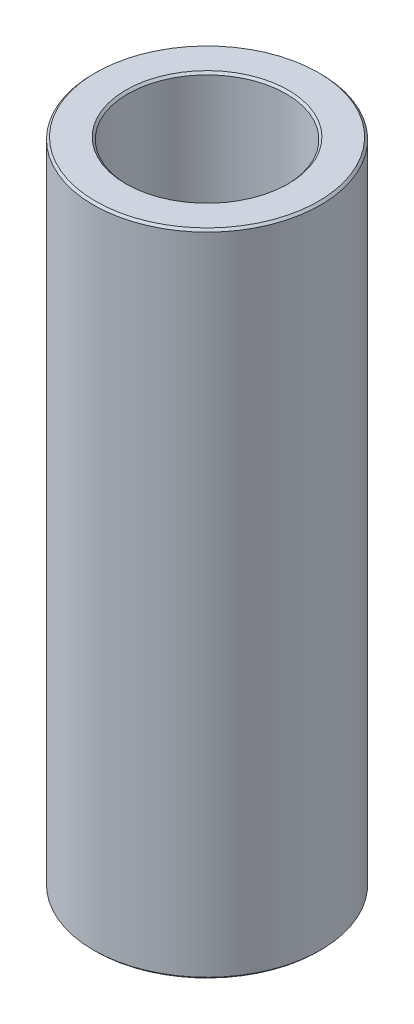
ISO-10303-21;
HEADER;
FILE_DESCRIPTION(('STEP AP214'),'2;1');
FILE_NAME('part.step','',(''),(''),'','','');
FILE_SCHEMA(('AUTOMOTIVE_DESIGN { 1 0 10303 214 1 1 1 1 }'));
ENDSEC;
DATA;
#1=APPLICATION_CONTEXT('core data for automotive mechanical design processes');
#2=APPLICATION_PROTOCOL_DEFINITION('international standard','automotive_design',2000,#1);
#3=PRODUCT_CONTEXT('',#1,'mechanical');
#4=PRODUCT('Part','Part','',(#3));
#5=PRODUCT_RELATED_PRODUCT_CATEGORY('part','',(#4));
#6=PRODUCT_DEFINITION_FORMATION('','',#4);
#7=PRODUCT_DEFINITION_CONTEXT('part definition',#1,'design');
#8=PRODUCT_DEFINITION('design','',#6,#7);
#9=PRODUCT_DEFINITION_SHAPE('','',#8);
#10=(LENGTH_UNIT() NAMED_UNIT(*) SI_UNIT(.MILLI.,.METRE.));
#11=(NAMED_UNIT(*) PLANE_ANGLE_UNIT() SI_UNIT($,.RADIAN.));
#12=(NAMED_UNIT(*) SI_UNIT($,.STERADIAN.) SOLID_ANGLE_UNIT());
#13=UNCERTAINTY_MEASURE_WITH_UNIT(LENGTH_MEASURE(1.E-05),#10,'distance_accuracy_value','');
#14=(GEOMETRIC_REPRESENTATION_CONTEXT(3) GLOBAL_UNCERTAINTY_ASSIGNED_CONTEXT((#13)) GLOBAL_UNIT_ASSIGNED_CONTEXT((#10,
#11,#12)) REPRESENTATION_CONTEXT('',''));
#15=CARTESIAN_POINT('',(0.,0.,0.));
#16=DIRECTION('',(0.,0.,1.));
#17=DIRECTION('',(1.,0.,0.));
#18=AXIS2_PLACEMENT_3D('',#15,#16,#17);
#19=CARTESIAN_POINT('',(0.,200.167303581127,0.));
#20=DIRECTION('',(0.,-1.,0.));
#21=DIRECTION('',(0.,0.,-1.));
#22=AXIS2_PLACEMENT_3D('',#19,#20,#21);
#23=CYLINDRICAL_SURFACE('',#22,35.);
#24=CARTESIAN_POINT('',(0.,0.663652062752096,0.));
#25=DIRECTION('',(0.,1.,0.));
#26=DIRECTION('',(0.,0.,1.));
#27=AXIS2_PLACEMENT_3D('',#24,#25,#26);
#28=CIRCLE('',#27,35.);
#29=CARTESIAN_POINT('',(0.,0.663652062752096,35.));
#30=VERTEX_POINT('',#29);
#31=EDGE_CURVE('E10',#30,#30,#28,.T.);
#32=ORIENTED_EDGE('',*,*,#31,.T.);
#33=EDGE_LOOP('',(#32));
#34=FACE_BOUND('',#33,.T.);
#35=CARTESIAN_POINT('',(0.,199.503651518375,0.));
#36=DIRECTION('',(0.,1.,0.));
#37=DIRECTION('',(0.,0.,1.));
#38=AXIS2_PLACEMENT_3D('',#35,#36,#37);
#39=CIRCLE('',#38,35.);
#40=CARTESIAN_POINT('',(0.,199.503651518375,35.));
#41=VERTEX_POINT('',#40);
#42=EDGE_CURVE('E50',#41,#41,#39,.F.);
#43=ORIENTED_EDGE('',*,*,#42,.T.);
#44=EDGE_LOOP('',(#43));
#45=FACE_BOUND('',#44,.T.);
#46=ADVANCED_FACE('F39',(#34,#45),#23,.T.);
#47=CARTESIAN_POINT('',(0.,200.167303581127,0.));
#48=DIRECTION('',(0.,1.,0.));
#49=DIRECTION('',(0.,0.,1.));
#50=AXIS2_PLACEMENT_3D('',#47,#48,#49);
#51=PLANE('',#50);
#52=CARTESIAN_POINT('',(0.,200.167303581127,0.));
#53=DIRECTION('',(0.,1.,0.));
#54=DIRECTION('',(0.,0.,1.));
#55=AXIS2_PLACEMENT_3D('',#52,#53,#54);
#56=CIRCLE('',#55,25.0389476209901);
#57=CARTESIAN_POINT('',(0.,200.167303581127,25.0389476209901));
#58=VERTEX_POINT('',#57);
#59=EDGE_CURVE('E58',#58,#58,#56,.F.);
#60=ORIENTED_EDGE('',*,*,#59,.T.);
#61=EDGE_LOOP('',(#60));
#62=FACE_BOUND('',#61,.T.);
#63=CARTESIAN_POINT('',(0.,200.167303581127,0.));
#64=DIRECTION('',(0.,1.,0.));
#65=DIRECTION('',(0.,0.,1.));
#66=AXIS2_PLACEMENT_3D('',#63,#64,#65);
#67=CIRCLE('',#66,34.3363479372479);
#68=CARTESIAN_POINT('',(0.,200.167303581127,34.3363479372479));
#69=VERTEX_POINT('',#68);
#70=EDGE_CURVE('E61',#69,#69,#67,.T.);
#71=ORIENTED_EDGE('',*,*,#70,.T.);
#72=EDGE_LOOP('',(#71));
#73=FACE_BOUND('',#72,.T.);
#74=ADVANCED_FACE('F88',(#62,#73),#51,.T.);
#75=CARTESIAN_POINT('',(0.,0.,0.));
#76=DIRECTION('',(0.,1.,0.));
#77=DIRECTION('',(0.,0.,1.));
#78=AXIS2_PLACEMENT_3D('',#75,#76,#77);
#79=PLANE('',#78);
#80=CARTESIAN_POINT('',(0.,0.,0.));
#81=DIRECTION('',(0.,1.,0.));
#82=DIRECTION('',(0.,0.,1.));
#83=AXIS2_PLACEMENT_3D('',#80,#81,#82);
#84=CIRCLE('',#83,25.0389476209901);
#85=CARTESIAN_POINT('',(0.,0.,25.0389476209901));
#86=VERTEX_POINT('',#85);
#87=EDGE_CURVE('E51',#86,#86,#84,.T.);
#88=ORIENTED_EDGE('',*,*,#87,.T.);
#89=EDGE_LOOP('',(#88));
#90=FACE_BOUND('',#89,.T.);
#91=CARTESIAN_POINT('',(0.,0.,0.));
#92=DIRECTION('',(0.,1.,0.));
#93=DIRECTION('',(0.,0.,1.));
#94=AXIS2_PLACEMENT_3D('',#91,#92,#93);
#95=CIRCLE('',#94,34.3363479372479);
#96=CARTESIAN_POINT('',(0.,0.,34.3363479372479));
#97=VERTEX_POINT('',#96);
#98=EDGE_CURVE('E54',#97,#97,#95,.F.);
#99=ORIENTED_EDGE('',*,*,#98,.T.);
#100=EDGE_LOOP('',(#99));
#101=FACE_BOUND('',#100,.T.);
#102=ADVANCED_FACE('F83',(#90,#101),#79,.F.);
#103=CARTESIAN_POINT('',(0.,200.167303581127,0.));
#104=DIRECTION('',(0.,-1.,0.));
#105=DIRECTION('',(0.,0.,-1.));
#106=AXIS2_PLACEMENT_3D('',#103,#104,#105);
#107=CYLINDRICAL_SURFACE('',#106,24.375295558238);
#108=CARTESIAN_POINT('',(0.,199.503651518375,0.));
#109=DIRECTION('',(0.,1.,0.));
#110=DIRECTION('',(0.,0.,1.));
#111=AXIS2_PLACEMENT_3D('',#108,#109,#110);
#112=CIRCLE('',#111,24.375295558238);
#113=CARTESIAN_POINT('',(0.,199.503651518375,24.375295558238));
#114=VERTEX_POINT('',#113);
#115=EDGE_CURVE('E67',#114,#114,#112,.T.);
#116=ORIENTED_EDGE('',*,*,#115,.T.);
#117=EDGE_LOOP('',(#116));
#118=FACE_BOUND('',#117,.T.);
#119=CARTESIAN_POINT('',(0.,0.663652062752124,0.));
#120=DIRECTION('',(0.,1.,0.));
#121=DIRECTION('',(0.,0.,1.));
#122=AXIS2_PLACEMENT_3D('',#119,#120,#121);
#123=CIRCLE('',#122,24.375295558238);
#124=CARTESIAN_POINT('',(0.,0.663652062752124,24.375295558238));
#125=VERTEX_POINT('',#124);
#126=EDGE_CURVE('E69',#125,#125,#123,.F.);
#127=ORIENTED_EDGE('',*,*,#126,.T.);
#128=EDGE_LOOP('',(#127));
#129=FACE_BOUND('',#128,.T.);
#130=ADVANCED_FACE('F71',(#118,#129),#107,.F.);
#131=CARTESIAN_POINT('',(0.,199.503651518375,0.));
#132=DIRECTION('',(0.,1.,0.));
#133=DIRECTION('',(0.,0.,1.));
#134=AXIS2_PLACEMENT_3D('',#131,#132,#133);
#135=CONICAL_SURFACE('',#134,24.375295558238,0.785398163397446);
#136=ORIENTED_EDGE('',*,*,#59,.F.);
#137=EDGE_LOOP('',(#136));
#138=FACE_BOUND('',#137,.T.);
#139=ORIENTED_EDGE('',*,*,#115,.F.);
#140=EDGE_LOOP('',(#139));
#141=FACE_BOUND('',#140,.T.);
#142=ADVANCED_FACE('F77',(#138,#141),#135,.F.);
#143=CARTESIAN_POINT('',(0.,0.,0.));
#144=DIRECTION('',(0.,-1.,0.));
#145=DIRECTION('',(0.,0.,-1.));
#146=AXIS2_PLACEMENT_3D('',#143,#144,#145);
#147=CONICAL_SURFACE('',#146,25.0389476209901,0.785398163397425);
#148=ORIENTED_EDGE('',*,*,#126,.F.);
#149=EDGE_LOOP('',(#148));
#150=FACE_BOUND('',#149,.T.);
#151=ORIENTED_EDGE('',*,*,#87,.F.);
#152=EDGE_LOOP('',(#151));
#153=FACE_BOUND('',#152,.T.);
#154=ADVANCED_FACE('F73',(#150,#153),#147,.F.);
#155=CARTESIAN_POINT('',(0.,0.663652062752096,0.));
#156=DIRECTION('',(0.,1.,0.));
#157=DIRECTION('',(0.,0.,1.));
#158=AXIS2_PLACEMENT_3D('',#155,#156,#157);
#159=CONICAL_SURFACE('',#158,35.,0.785398163397464);
#160=ORIENTED_EDGE('',*,*,#98,.F.);
#161=EDGE_LOOP('',(#160));
#162=FACE_BOUND('',#161,.T.);
#163=ORIENTED_EDGE('',*,*,#31,.F.);
#164=EDGE_LOOP('',(#163));
#165=FACE_BOUND('',#164,.T.);
#166=ADVANCED_FACE('F76',(#162,#165),#159,.T.);
#167=CARTESIAN_POINT('',(0.,200.167303581127,0.));
#168=DIRECTION('',(0.,-1.,0.));
#169=DIRECTION('',(0.,0.,-1.));
#170=AXIS2_PLACEMENT_3D('',#167,#168,#169);
#171=CONICAL_SURFACE('',#170,34.3363479372479,0.785398163397454);
#172=ORIENTED_EDGE('',*,*,#42,.F.);
#173=EDGE_LOOP('',(#172));
#174=FACE_BOUND('',#173,.T.);
#175=ORIENTED_EDGE('',*,*,#70,.F.);
#176=EDGE_LOOP('',(#175));
#177=FACE_BOUND('',#176,.T.);
#178=ADVANCED_FACE('F45',(#174,#177),#171,.T.);
#179=CLOSED_SHELL('',(#46,#74,#102,#130,#142,#154,#166,#178));
#180=MANIFOLD_SOLID_BREP('B2',#179);
#181=ADVANCED_BREP_SHAPE_REPRESENTATION('',(#18,#180),#14);
#182=SHAPE_DEFINITION_REPRESENTATION(#9,#181);
ENDSEC;
END-ISO-10303-21;
